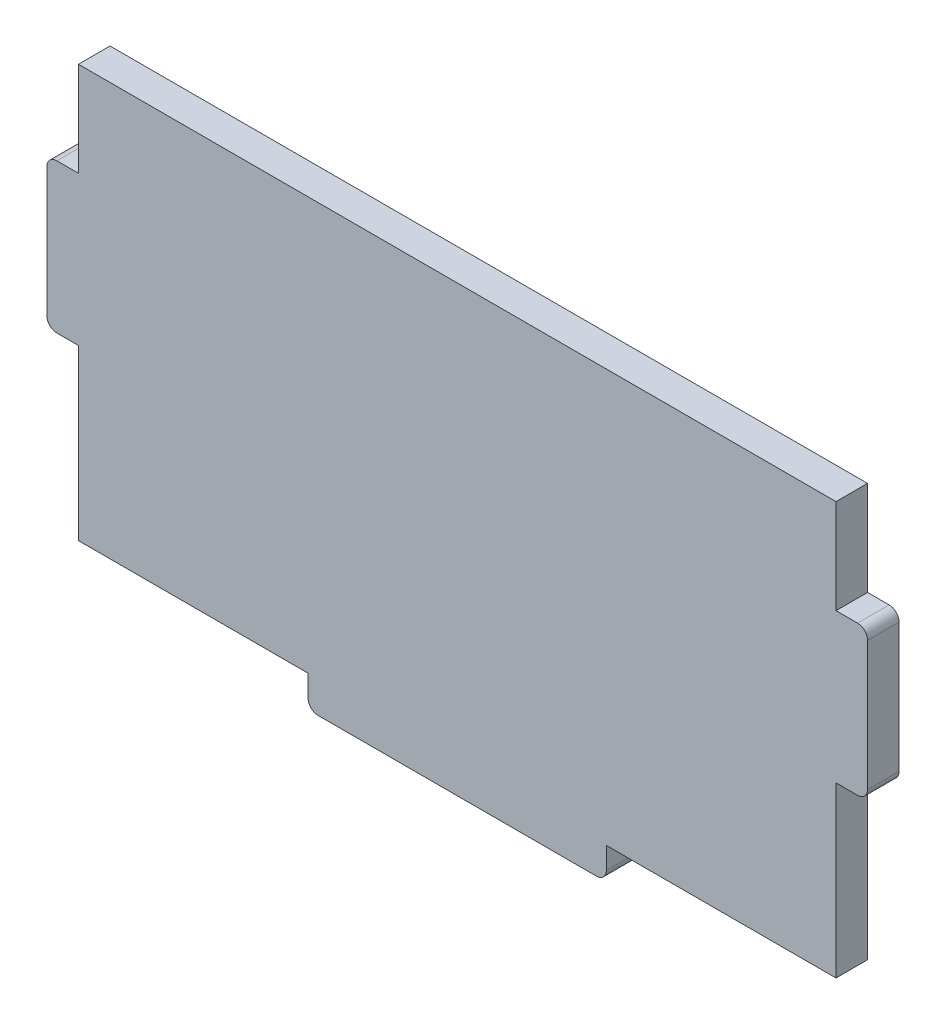
ISO-10303-21;
HEADER;
FILE_DESCRIPTION(('STEP AP214'),'2;1');
FILE_NAME('part.step','',(''),(''),'','','');
FILE_SCHEMA(('AUTOMOTIVE_DESIGN { 1 0 10303 214 1 1 1 1 }'));
ENDSEC;
DATA;
#1=APPLICATION_CONTEXT('core data for automotive mechanical design processes');
#2=APPLICATION_PROTOCOL_DEFINITION('international standard','automotive_design',2000,#1);
#3=PRODUCT_CONTEXT('',#1,'mechanical');
#4=PRODUCT('Part','Part','',(#3));
#5=PRODUCT_RELATED_PRODUCT_CATEGORY('part','',(#4));
#6=PRODUCT_DEFINITION_FORMATION('','',#4);
#7=PRODUCT_DEFINITION_CONTEXT('part definition',#1,'design');
#8=PRODUCT_DEFINITION('design','',#6,#7);
#9=PRODUCT_DEFINITION_SHAPE('','',#8);
#10=(LENGTH_UNIT() NAMED_UNIT(*) SI_UNIT(.MILLI.,.METRE.));
#11=(NAMED_UNIT(*) PLANE_ANGLE_UNIT() SI_UNIT($,.RADIAN.));
#12=(NAMED_UNIT(*) SI_UNIT($,.STERADIAN.) SOLID_ANGLE_UNIT());
#13=UNCERTAINTY_MEASURE_WITH_UNIT(LENGTH_MEASURE(1.E-05),#10,'distance_accuracy_value','');
#14=(GEOMETRIC_REPRESENTATION_CONTEXT(3) GLOBAL_UNCERTAINTY_ASSIGNED_CONTEXT((#13)) GLOBAL_UNIT_ASSIGNED_CONTEXT((#10,
#11,#12)) REPRESENTATION_CONTEXT('',''));
#15=CARTESIAN_POINT('',(0.,0.,0.));
#16=DIRECTION('',(0.,0.,1.));
#17=DIRECTION('',(1.,0.,0.));
#18=AXIS2_PLACEMENT_3D('',#15,#16,#17);
#19=CARTESIAN_POINT('',(-38.1,-20.75,3.175));
#20=DIRECTION('',(1.,0.,0.));
#21=DIRECTION('',(0.,1.,0.));
#22=AXIS2_PLACEMENT_3D('',#19,#20,#21);
#23=PLANE('',#22);
#24=DIRECTION('',(0.,0.,-1.));
#25=VECTOR('',#24,1.);
#26=CARTESIAN_POINT('',(-38.1,11.25,0.));
#27=LINE('',#26,#25);
#28=CARTESIAN_POINT('',(-38.1,11.25,3.175));
#29=VERTEX_POINT('',#28);
#30=CARTESIAN_POINT('',(-38.1,11.25,0.));
#31=VERTEX_POINT('',#30);
#32=EDGE_CURVE('E226',#29,#31,#27,.T.);
#33=ORIENTED_EDGE('',*,*,#32,.F.);
#34=DIRECTION('',(0.,-1.,0.));
#35=VECTOR('',#34,1.);
#36=CARTESIAN_POINT('',(-38.1,-20.75,3.175));
#37=LINE('',#36,#35);
#38=CARTESIAN_POINT('',(-38.1,20.75,3.175));
#39=VERTEX_POINT('',#38);
#40=EDGE_CURVE('E220',#39,#29,#37,.T.);
#41=ORIENTED_EDGE('',*,*,#40,.F.);
#42=DIRECTION('',(0.,0.,-1.));
#43=VECTOR('',#42,1.);
#44=CARTESIAN_POINT('',(-38.1,20.75,3.175));
#45=LINE('',#44,#43);
#46=CARTESIAN_POINT('',(-38.1,20.75,0.));
#47=VERTEX_POINT('',#46);
#48=EDGE_CURVE('E336',#39,#47,#45,.T.);
#49=ORIENTED_EDGE('',*,*,#48,.T.);
#50=DIRECTION('',(0.,-1.,0.));
#51=VECTOR('',#50,1.);
#52=CARTESIAN_POINT('',(-38.1,-20.75,0.));
#53=LINE('',#52,#51);
#54=EDGE_CURVE('E322',#47,#31,#53,.T.);
#55=ORIENTED_EDGE('',*,*,#54,.T.);
#56=EDGE_LOOP('',(#33,#41,#49,#55));
#57=FACE_BOUND('',#56,.T.);
#58=ADVANCED_FACE('F48',(#57),#23,.F.);
#59=DIRECTION('',(0.,0.,1.));
#60=VECTOR('',#59,1.);
#61=CARTESIAN_POINT('',(-38.1,-3.75000000000002,0.));
#62=LINE('',#61,#60);
#63=CARTESIAN_POINT('',(-38.1,-3.75000000000002,0.));
#64=VERTEX_POINT('',#63);
#65=CARTESIAN_POINT('',(-38.1,-3.75000000000002,3.175));
#66=VERTEX_POINT('',#65);
#67=EDGE_CURVE('E214',#64,#66,#62,.T.);
#68=ORIENTED_EDGE('',*,*,#67,.F.);
#69=CARTESIAN_POINT('',(-38.1,-20.75,0.));
#70=VERTEX_POINT('',#69);
#71=EDGE_CURVE('E321',#64,#70,#53,.T.);
#72=ORIENTED_EDGE('',*,*,#71,.T.);
#73=DIRECTION('',(0.,0.,-1.));
#74=VECTOR('',#73,1.);
#75=CARTESIAN_POINT('',(-38.1,-20.75,3.175));
#76=LINE('',#75,#74);
#77=CARTESIAN_POINT('',(-38.1,-20.75,3.175));
#78=VERTEX_POINT('',#77);
#79=EDGE_CURVE('E217',#78,#70,#76,.T.);
#80=ORIENTED_EDGE('',*,*,#79,.F.);
#81=EDGE_CURVE('E200',#66,#78,#37,.T.);
#82=ORIENTED_EDGE('',*,*,#81,.F.);
#83=EDGE_LOOP('',(#68,#72,#80,#82));
#84=FACE_BOUND('',#83,.T.);
#85=ADVANCED_FACE('F213',(#84),#23,.F.);
#86=CARTESIAN_POINT('',(-38.1,-20.75,3.175));
#87=DIRECTION('',(0.,1.,0.));
#88=DIRECTION('',(-1.,0.,0.));
#89=AXIS2_PLACEMENT_3D('',#86,#87,#88);
#90=PLANE('',#89);
#91=DIRECTION('',(0.,0.,-1.));
#92=VECTOR('',#91,1.);
#93=CARTESIAN_POINT('',(-15.,-20.75,3.175));
#94=LINE('',#93,#92);
#95=CARTESIAN_POINT('',(-15.,-20.75,3.175));
#96=VERTEX_POINT('',#95);
#97=CARTESIAN_POINT('',(-15.,-20.75,0.));
#98=VERTEX_POINT('',#97);
#99=EDGE_CURVE('E243',#96,#98,#94,.T.);
#100=ORIENTED_EDGE('',*,*,#99,.F.);
#101=DIRECTION('',(1.,0.,0.));
#102=VECTOR('',#101,1.);
#103=CARTESIAN_POINT('',(-38.1,-20.75,3.175));
#104=LINE('',#103,#102);
#105=EDGE_CURVE('E310',#78,#96,#104,.T.);
#106=ORIENTED_EDGE('',*,*,#105,.F.);
#107=ORIENTED_EDGE('',*,*,#79,.T.);
#108=DIRECTION('',(1.,0.,0.));
#109=VECTOR('',#108,1.);
#110=CARTESIAN_POINT('',(-38.1,-20.75,0.));
#111=LINE('',#110,#109);
#112=EDGE_CURVE('E327',#70,#98,#111,.T.);
#113=ORIENTED_EDGE('',*,*,#112,.T.);
#114=EDGE_LOOP('',(#100,#106,#107,#113));
#115=FACE_BOUND('',#114,.T.);
#116=ADVANCED_FACE('F494',(#115),#90,.F.);
#117=DIRECTION('',(0.,0.,1.));
#118=VECTOR('',#117,1.);
#119=CARTESIAN_POINT('',(15.,-20.75,3.175));
#120=LINE('',#119,#118);
#121=CARTESIAN_POINT('',(15.,-20.75,0.));
#122=VERTEX_POINT('',#121);
#123=CARTESIAN_POINT('',(15.,-20.75,3.175));
#124=VERTEX_POINT('',#123);
#125=EDGE_CURVE('E249',#122,#124,#120,.T.);
#126=ORIENTED_EDGE('',*,*,#125,.F.);
#127=CARTESIAN_POINT('',(38.1,-20.75,0.));
#128=VERTEX_POINT('',#127);
#129=EDGE_CURVE('E326',#122,#128,#111,.T.);
#130=ORIENTED_EDGE('',*,*,#129,.T.);
#131=DIRECTION('',(0.,0.,-1.));
#132=VECTOR('',#131,1.);
#133=CARTESIAN_POINT('',(38.1,-20.75,3.175));
#134=LINE('',#133,#132);
#135=CARTESIAN_POINT('',(38.1,-20.75,3.175));
#136=VERTEX_POINT('',#135);
#137=EDGE_CURVE('E313',#136,#128,#134,.T.);
#138=ORIENTED_EDGE('',*,*,#137,.F.);
#139=EDGE_CURVE('E309',#124,#136,#104,.T.);
#140=ORIENTED_EDGE('',*,*,#139,.F.);
#141=EDGE_LOOP('',(#126,#130,#138,#140));
#142=FACE_BOUND('',#141,.T.);
#143=ADVANCED_FACE('F441',(#142),#90,.F.);
#144=CARTESIAN_POINT('',(38.1,-20.75,3.175));
#145=DIRECTION('',(-1.,0.,0.));
#146=DIRECTION('',(0.,-1.,0.));
#147=AXIS2_PLACEMENT_3D('',#144,#145,#146);
#148=PLANE('',#147);
#149=DIRECTION('',(0.,0.,1.));
#150=VECTOR('',#149,1.);
#151=CARTESIAN_POINT('',(38.1,11.25,3.175));
#152=LINE('',#151,#150);
#153=CARTESIAN_POINT('',(38.1,11.25,0.));
#154=VERTEX_POINT('',#153);
#155=CARTESIAN_POINT('',(38.1,11.25,3.175));
#156=VERTEX_POINT('',#155);
#157=EDGE_CURVE('E277',#154,#156,#152,.T.);
#158=ORIENTED_EDGE('',*,*,#157,.F.);
#159=DIRECTION('',(0.,1.,0.));
#160=VECTOR('',#159,1.);
#161=CARTESIAN_POINT('',(38.1,-20.75,0.));
#162=LINE('',#161,#160);
#163=CARTESIAN_POINT('',(38.1,20.75,0.));
#164=VERTEX_POINT('',#163);
#165=EDGE_CURVE('E299',#154,#164,#162,.T.);
#166=ORIENTED_EDGE('',*,*,#165,.T.);
#167=DIRECTION('',(0.,0.,-1.));
#168=VECTOR('',#167,1.);
#169=CARTESIAN_POINT('',(38.1,20.75,3.175));
#170=LINE('',#169,#168);
#171=CARTESIAN_POINT('',(38.1,20.75,3.175));
#172=VERTEX_POINT('',#171);
#173=EDGE_CURVE('E340',#172,#164,#170,.T.);
#174=ORIENTED_EDGE('',*,*,#173,.F.);
#175=DIRECTION('',(0.,1.,0.));
#176=VECTOR('',#175,1.);
#177=CARTESIAN_POINT('',(38.1,-20.75,3.175));
#178=LINE('',#177,#176);
#179=EDGE_CURVE('E304',#156,#172,#178,.T.);
#180=ORIENTED_EDGE('',*,*,#179,.F.);
#181=EDGE_LOOP('',(#158,#166,#174,#180));
#182=FACE_BOUND('',#181,.T.);
#183=ADVANCED_FACE('F468',(#182),#148,.F.);
#184=DIRECTION('',(0.,0.,-1.));
#185=VECTOR('',#184,1.);
#186=CARTESIAN_POINT('',(38.1,-3.74999999999999,3.175));
#187=LINE('',#186,#185);
#188=CARTESIAN_POINT('',(38.1,-3.74999999999999,3.175));
#189=VERTEX_POINT('',#188);
#190=CARTESIAN_POINT('',(38.1,-3.74999999999999,0.));
#191=VERTEX_POINT('',#190);
#192=EDGE_CURVE('E271',#189,#191,#187,.T.);
#193=ORIENTED_EDGE('',*,*,#192,.F.);
#194=EDGE_CURVE('E300',#136,#189,#178,.T.);
#195=ORIENTED_EDGE('',*,*,#194,.F.);
#196=ORIENTED_EDGE('',*,*,#137,.T.);
#197=EDGE_CURVE('E314',#128,#191,#162,.T.);
#198=ORIENTED_EDGE('',*,*,#197,.T.);
#199=EDGE_LOOP('',(#193,#195,#196,#198));
#200=FACE_BOUND('',#199,.T.);
#201=ADVANCED_FACE('F446',(#200),#148,.F.);
#202=CARTESIAN_POINT('',(-38.1,20.75,3.175));
#203=DIRECTION('',(0.,-1.,0.));
#204=DIRECTION('',(1.,0.,0.));
#205=AXIS2_PLACEMENT_3D('',#202,#203,#204);
#206=PLANE('',#205);
#207=DIRECTION('',(-1.,0.,0.));
#208=VECTOR('',#207,1.);
#209=CARTESIAN_POINT('',(-38.1,20.75,0.));
#210=LINE('',#209,#208);
#211=EDGE_CURVE('E318',#164,#47,#210,.T.);
#212=ORIENTED_EDGE('',*,*,#211,.T.);
#213=ORIENTED_EDGE('',*,*,#48,.F.);
#214=DIRECTION('',(-1.,0.,0.));
#215=VECTOR('',#214,1.);
#216=CARTESIAN_POINT('',(-38.1,20.75,3.175));
#217=LINE('',#216,#215);
#218=EDGE_CURVE('E221',#172,#39,#217,.T.);
#219=ORIENTED_EDGE('',*,*,#218,.F.);
#220=ORIENTED_EDGE('',*,*,#173,.T.);
#221=EDGE_LOOP('',(#212,#213,#219,#220));
#222=FACE_BOUND('',#221,.T.);
#223=ADVANCED_FACE('F475',(#222),#206,.F.);
#224=CARTESIAN_POINT('',(0.,0.,3.175));
#225=DIRECTION('',(0.,0.,-1.));
#226=DIRECTION('',(-1.,0.,0.));
#227=AXIS2_PLACEMENT_3D('',#224,#225,#226);
#228=PLANE('',#227);
#229=DIRECTION('',(0.,-1.,0.));
#230=VECTOR('',#229,1.);
#231=CARTESIAN_POINT('',(41.275,11.25,3.175));
#232=LINE('',#231,#230);
#233=CARTESIAN_POINT('',(41.275,10.25,3.175));
#234=VERTEX_POINT('',#233);
#235=CARTESIAN_POINT('',(41.275,-2.74999999999999,3.175));
#236=VERTEX_POINT('',#235);
#237=EDGE_CURVE('E272',#234,#236,#232,.T.);
#238=ORIENTED_EDGE('',*,*,#237,.F.);
#239=CARTESIAN_POINT('',(40.275,10.25,3.175));
#240=DIRECTION('',(0.,0.,-1.));
#241=DIRECTION('',(-1.,0.,0.));
#242=AXIS2_PLACEMENT_3D('',#239,#240,#241);
#243=CIRCLE('',#242,1.);
#244=CARTESIAN_POINT('',(40.275,11.25,3.175));
#245=VERTEX_POINT('',#244);
#246=EDGE_CURVE('E366',#234,#245,#243,.F.);
#247=ORIENTED_EDGE('',*,*,#246,.T.);
#248=DIRECTION('',(-1.,0.,0.));
#249=VECTOR('',#248,1.);
#250=CARTESIAN_POINT('',(41.275,11.25,3.175));
#251=LINE('',#250,#249);
#252=EDGE_CURVE('E281',#245,#156,#251,.T.);
#253=ORIENTED_EDGE('',*,*,#252,.T.);
#254=ORIENTED_EDGE('',*,*,#179,.T.);
#255=ORIENTED_EDGE('',*,*,#218,.T.);
#256=ORIENTED_EDGE('',*,*,#40,.T.);
#257=DIRECTION('',(1.,0.,0.));
#258=VECTOR('',#257,1.);
#259=CARTESIAN_POINT('',(-41.275,11.25,3.175));
#260=LINE('',#259,#258);
#261=CARTESIAN_POINT('',(-40.275,11.25,3.175));
#262=VERTEX_POINT('',#261);
#263=EDGE_CURVE('E209',#262,#29,#260,.T.);
#264=ORIENTED_EDGE('',*,*,#263,.F.);
#265=CARTESIAN_POINT('',(-40.275,10.25,3.175));
#266=DIRECTION('',(0.,0.,-1.));
#267=DIRECTION('',(-1.,0.,0.));
#268=AXIS2_PLACEMENT_3D('',#265,#266,#267);
#269=CIRCLE('',#268,1.);
#270=CARTESIAN_POINT('',(-41.275,10.25,3.175));
#271=VERTEX_POINT('',#270);
#272=EDGE_CURVE('E352',#262,#271,#269,.F.);
#273=ORIENTED_EDGE('',*,*,#272,.T.);
#274=DIRECTION('',(0.,1.,0.));
#275=VECTOR('',#274,1.);
#276=CARTESIAN_POINT('',(-41.275,11.25,3.175));
#277=LINE('',#276,#275);
#278=CARTESIAN_POINT('',(-41.275,-2.75000000000002,3.175));
#279=VERTEX_POINT('',#278);
#280=EDGE_CURVE('E233',#279,#271,#277,.T.);
#281=ORIENTED_EDGE('',*,*,#280,.F.);
#282=CARTESIAN_POINT('',(-40.275,-2.75000000000002,3.175));
#283=DIRECTION('',(0.,0.,-1.));
#284=DIRECTION('',(-1.,0.,0.));
#285=AXIS2_PLACEMENT_3D('',#282,#283,#284);
#286=CIRCLE('',#285,1.);
#287=CARTESIAN_POINT('',(-40.275,-3.75000000000002,3.175));
#288=VERTEX_POINT('',#287);
#289=EDGE_CURVE('E203',#279,#288,#286,.F.);
#290=ORIENTED_EDGE('',*,*,#289,.T.);
#291=DIRECTION('',(1.,0.,0.));
#292=VECTOR('',#291,1.);
#293=CARTESIAN_POINT('',(-41.275,-3.75000000000002,3.175));
#294=LINE('',#293,#292);
#295=EDGE_CURVE('E195',#288,#66,#294,.T.);
#296=ORIENTED_EDGE('',*,*,#295,.T.);
#297=ORIENTED_EDGE('',*,*,#81,.T.);
#298=ORIENTED_EDGE('',*,*,#105,.T.);
#299=DIRECTION('',(0.,1.,0.));
#300=VECTOR('',#299,1.);
#301=CARTESIAN_POINT('',(-15.,-23.925,3.175));
#302=LINE('',#301,#300);
#303=CARTESIAN_POINT('',(-15.,-22.925,3.175));
#304=VERTEX_POINT('',#303);
#305=EDGE_CURVE('E253',#304,#96,#302,.T.);
#306=ORIENTED_EDGE('',*,*,#305,.F.);
#307=CARTESIAN_POINT('',(-14.,-22.925,3.175));
#308=DIRECTION('',(0.,0.,-1.));
#309=DIRECTION('',(-1.,0.,0.));
#310=AXIS2_PLACEMENT_3D('',#307,#308,#309);
#311=CIRCLE('',#310,1.);
#312=CARTESIAN_POINT('',(-14.,-23.925,3.175));
#313=VERTEX_POINT('',#312);
#314=EDGE_CURVE('E357',#304,#313,#311,.F.);
#315=ORIENTED_EDGE('',*,*,#314,.T.);
#316=DIRECTION('',(-1.,0.,0.));
#317=VECTOR('',#316,1.);
#318=CARTESIAN_POINT('',(-15.,-23.925,3.175));
#319=LINE('',#318,#317);
#320=CARTESIAN_POINT('',(14.,-23.925,3.175));
#321=VERTEX_POINT('',#320);
#322=EDGE_CURVE('E248',#321,#313,#319,.T.);
#323=ORIENTED_EDGE('',*,*,#322,.F.);
#324=CARTESIAN_POINT('',(14.,-22.925,3.175));
#325=DIRECTION('',(0.,0.,-1.));
#326=DIRECTION('',(-1.,0.,0.));
#327=AXIS2_PLACEMENT_3D('',#324,#325,#326);
#328=CIRCLE('',#327,1.);
#329=CARTESIAN_POINT('',(15.,-22.925,3.175));
#330=VERTEX_POINT('',#329);
#331=EDGE_CURVE('E360',#321,#330,#328,.F.);
#332=ORIENTED_EDGE('',*,*,#331,.T.);
#333=DIRECTION('',(0.,1.,0.));
#334=VECTOR('',#333,1.);
#335=CARTESIAN_POINT('',(15.,-23.925,3.175));
#336=LINE('',#335,#334);
#337=EDGE_CURVE('E262',#330,#124,#336,.T.);
#338=ORIENTED_EDGE('',*,*,#337,.T.);
#339=ORIENTED_EDGE('',*,*,#139,.T.);
#340=ORIENTED_EDGE('',*,*,#194,.T.);
#341=DIRECTION('',(-1.,0.,0.));
#342=VECTOR('',#341,1.);
#343=CARTESIAN_POINT('',(41.275,-3.74999999999999,3.175));
#344=LINE('',#343,#342);
#345=CARTESIAN_POINT('',(40.275,-3.74999999999999,3.175));
#346=VERTEX_POINT('',#345);
#347=EDGE_CURVE('E296',#346,#189,#344,.T.);
#348=ORIENTED_EDGE('',*,*,#347,.F.);
#349=CARTESIAN_POINT('',(40.275,-2.74999999999999,3.175));
#350=DIRECTION('',(0.,0.,-1.));
#351=DIRECTION('',(-1.,0.,0.));
#352=AXIS2_PLACEMENT_3D('',#349,#350,#351);
#353=CIRCLE('',#352,1.);
#354=EDGE_CURVE('E363',#346,#236,#353,.F.);
#355=ORIENTED_EDGE('',*,*,#354,.T.);
#356=EDGE_LOOP('',(#238,#247,#253,#254,#255,#256,#264,#273,#281,#290,#296,#297,#298,#306,#315,
#323,#332,#338,#339,#340,#348,#355));
#357=FACE_BOUND('',#356,.T.);
#358=ADVANCED_FACE('F198',(#357),#228,.F.);
#359=CARTESIAN_POINT('',(0.,0.,0.));
#360=DIRECTION('',(0.,0.,-1.));
#361=DIRECTION('',(-1.,0.,0.));
#362=AXIS2_PLACEMENT_3D('',#359,#360,#361);
#363=PLANE('',#362);
#364=DIRECTION('',(-1.,0.,0.));
#365=VECTOR('',#364,1.);
#366=CARTESIAN_POINT('',(41.275,11.25,0.));
#367=LINE('',#366,#365);
#368=CARTESIAN_POINT('',(40.275,11.25,0.));
#369=VERTEX_POINT('',#368);
#370=EDGE_CURVE('E290',#369,#154,#367,.T.);
#371=ORIENTED_EDGE('',*,*,#370,.F.);
#372=CARTESIAN_POINT('',(40.275,10.25,0.));
#373=DIRECTION('',(0.,0.,-1.));
#374=DIRECTION('',(-1.,0.,0.));
#375=AXIS2_PLACEMENT_3D('',#372,#373,#374);
#376=CIRCLE('',#375,1.);
#377=CARTESIAN_POINT('',(41.275,10.25,0.));
#378=VERTEX_POINT('',#377);
#379=EDGE_CURVE('E385',#369,#378,#376,.T.);
#380=ORIENTED_EDGE('',*,*,#379,.T.);
#381=DIRECTION('',(0.,1.,0.));
#382=VECTOR('',#381,1.);
#383=CARTESIAN_POINT('',(41.275,11.25,0.));
#384=LINE('',#383,#382);
#385=CARTESIAN_POINT('',(41.275,-2.74999999999999,0.));
#386=VERTEX_POINT('',#385);
#387=EDGE_CURVE('E276',#386,#378,#384,.T.);
#388=ORIENTED_EDGE('',*,*,#387,.F.);
#389=CARTESIAN_POINT('',(40.275,-2.74999999999999,0.));
#390=DIRECTION('',(0.,0.,-1.));
#391=DIRECTION('',(-1.,0.,0.));
#392=AXIS2_PLACEMENT_3D('',#389,#390,#391);
#393=CIRCLE('',#392,1.);
#394=CARTESIAN_POINT('',(40.275,-3.74999999999999,0.));
#395=VERTEX_POINT('',#394);
#396=EDGE_CURVE('E64',#386,#395,#393,.T.);
#397=ORIENTED_EDGE('',*,*,#396,.T.);
#398=DIRECTION('',(-1.,0.,0.));
#399=VECTOR('',#398,1.);
#400=CARTESIAN_POINT('',(41.275,-3.74999999999999,0.));
#401=LINE('',#400,#399);
#402=EDGE_CURVE('E293',#395,#191,#401,.T.);
#403=ORIENTED_EDGE('',*,*,#402,.T.);
#404=ORIENTED_EDGE('',*,*,#197,.F.);
#405=ORIENTED_EDGE('',*,*,#129,.F.);
#406=DIRECTION('',(0.,1.,0.));
#407=VECTOR('',#406,1.);
#408=CARTESIAN_POINT('',(15.,-23.925,0.));
#409=LINE('',#408,#407);
#410=CARTESIAN_POINT('',(15.,-22.925,0.));
#411=VERTEX_POINT('',#410);
#412=EDGE_CURVE('E265',#411,#122,#409,.T.);
#413=ORIENTED_EDGE('',*,*,#412,.F.);
#414=CARTESIAN_POINT('',(14.,-22.925,0.));
#415=DIRECTION('',(0.,0.,-1.));
#416=DIRECTION('',(-1.,0.,0.));
#417=AXIS2_PLACEMENT_3D('',#414,#415,#416);
#418=CIRCLE('',#417,1.);
#419=CARTESIAN_POINT('',(14.,-23.925,0.));
#420=VERTEX_POINT('',#419);
#421=EDGE_CURVE('E380',#411,#420,#418,.T.);
#422=ORIENTED_EDGE('',*,*,#421,.T.);
#423=DIRECTION('',(1.,0.,0.));
#424=VECTOR('',#423,1.);
#425=CARTESIAN_POINT('',(-15.,-23.925,0.));
#426=LINE('',#425,#424);
#427=CARTESIAN_POINT('',(-14.,-23.925,0.));
#428=VERTEX_POINT('',#427);
#429=EDGE_CURVE('E244',#428,#420,#426,.T.);
#430=ORIENTED_EDGE('',*,*,#429,.F.);
#431=CARTESIAN_POINT('',(-14.,-22.925,0.));
#432=DIRECTION('',(0.,0.,-1.));
#433=DIRECTION('',(-1.,0.,0.));
#434=AXIS2_PLACEMENT_3D('',#431,#432,#433);
#435=CIRCLE('',#434,1.);
#436=CARTESIAN_POINT('',(-15.,-22.925,0.));
#437=VERTEX_POINT('',#436);
#438=EDGE_CURVE('E377',#428,#437,#435,.T.);
#439=ORIENTED_EDGE('',*,*,#438,.T.);
#440=DIRECTION('',(0.,1.,0.));
#441=VECTOR('',#440,1.);
#442=CARTESIAN_POINT('',(-15.,-23.925,0.));
#443=LINE('',#442,#441);
#444=EDGE_CURVE('E268',#437,#98,#443,.T.);
#445=ORIENTED_EDGE('',*,*,#444,.T.);
#446=ORIENTED_EDGE('',*,*,#112,.F.);
#447=ORIENTED_EDGE('',*,*,#71,.F.);
#448=DIRECTION('',(1.,0.,0.));
#449=VECTOR('',#448,1.);
#450=CARTESIAN_POINT('',(-41.275,-3.75000000000002,0.));
#451=LINE('',#450,#449);
#452=CARTESIAN_POINT('',(-40.275,-3.75000000000002,0.));
#453=VERTEX_POINT('',#452);
#454=EDGE_CURVE('E208',#453,#64,#451,.T.);
#455=ORIENTED_EDGE('',*,*,#454,.F.);
#456=CARTESIAN_POINT('',(-40.275,-2.75000000000002,0.));
#457=DIRECTION('',(0.,0.,-1.));
#458=DIRECTION('',(-1.,0.,0.));
#459=AXIS2_PLACEMENT_3D('',#456,#457,#458);
#460=CIRCLE('',#459,1.);
#461=CARTESIAN_POINT('',(-41.275,-2.75000000000002,0.));
#462=VERTEX_POINT('',#461);
#463=EDGE_CURVE('E374',#453,#462,#460,.T.);
#464=ORIENTED_EDGE('',*,*,#463,.T.);
#465=DIRECTION('',(0.,-1.,0.));
#466=VECTOR('',#465,1.);
#467=CARTESIAN_POINT('',(-41.275,11.25,0.));
#468=LINE('',#467,#466);
#469=CARTESIAN_POINT('',(-41.275,10.25,0.));
#470=VERTEX_POINT('',#469);
#471=EDGE_CURVE('E230',#470,#462,#468,.T.);
#472=ORIENTED_EDGE('',*,*,#471,.F.);
#473=CARTESIAN_POINT('',(-40.275,10.25,0.));
#474=DIRECTION('',(0.,0.,-1.));
#475=DIRECTION('',(-1.,0.,0.));
#476=AXIS2_PLACEMENT_3D('',#473,#474,#475);
#477=CIRCLE('',#476,1.);
#478=CARTESIAN_POINT('',(-40.275,11.25,0.));
#479=VERTEX_POINT('',#478);
#480=EDGE_CURVE('E71',#470,#479,#477,.T.);
#481=ORIENTED_EDGE('',*,*,#480,.T.);
#482=DIRECTION('',(1.,0.,0.));
#483=VECTOR('',#482,1.);
#484=CARTESIAN_POINT('',(-41.275,11.25,0.));
#485=LINE('',#484,#483);
#486=EDGE_CURVE('E236',#479,#31,#485,.T.);
#487=ORIENTED_EDGE('',*,*,#486,.T.);
#488=ORIENTED_EDGE('',*,*,#54,.F.);
#489=ORIENTED_EDGE('',*,*,#211,.F.);
#490=ORIENTED_EDGE('',*,*,#165,.F.);
#491=EDGE_LOOP('',(#371,#380,#388,#397,#403,#404,#405,#413,#422,#430,#439,#445,#446,#447,#455,
#464,#472,#481,#487,#488,#489,#490));
#492=FACE_BOUND('',#491,.T.);
#493=ADVANCED_FACE('F416',(#492),#363,.T.);
#494=CARTESIAN_POINT('',(41.275,-3.74999999999999,3.175));
#495=DIRECTION('',(0.,1.,0.));
#496=DIRECTION('',(-1.,0.,0.));
#497=AXIS2_PLACEMENT_3D('',#494,#495,#496);
#498=PLANE('',#497);
#499=ORIENTED_EDGE('',*,*,#402,.F.);
#500=DIRECTION('',(0.,0.,-1.));
#501=VECTOR('',#500,1.);
#502=CARTESIAN_POINT('',(40.275,-3.74999999999999,3.175));
#503=LINE('',#502,#501);
#504=EDGE_CURVE('E388',#395,#346,#503,.F.);
#505=ORIENTED_EDGE('',*,*,#504,.T.);
#506=ORIENTED_EDGE('',*,*,#347,.T.);
#507=ORIENTED_EDGE('',*,*,#192,.T.);
#508=EDGE_LOOP('',(#499,#505,#506,#507));
#509=FACE_BOUND('',#508,.T.);
#510=ADVANCED_FACE('F448',(#509),#498,.F.);
#511=CARTESIAN_POINT('',(41.275,11.25,3.175));
#512=DIRECTION('',(0.,-1.,0.));
#513=DIRECTION('',(1.,0.,0.));
#514=AXIS2_PLACEMENT_3D('',#511,#512,#513);
#515=PLANE('',#514);
#516=ORIENTED_EDGE('',*,*,#252,.F.);
#517=DIRECTION('',(0.,0.,1.));
#518=VECTOR('',#517,1.);
#519=CARTESIAN_POINT('',(40.275,11.25,0.));
#520=LINE('',#519,#518);
#521=EDGE_CURVE('E369',#245,#369,#520,.F.);
#522=ORIENTED_EDGE('',*,*,#521,.T.);
#523=ORIENTED_EDGE('',*,*,#370,.T.);
#524=ORIENTED_EDGE('',*,*,#157,.T.);
#525=EDGE_LOOP('',(#516,#522,#523,#524));
#526=FACE_BOUND('',#525,.T.);
#527=ADVANCED_FACE('F465',(#526),#515,.F.);
#528=CARTESIAN_POINT('',(41.275,0.,0.));
#529=DIRECTION('',(1.,0.,0.));
#530=DIRECTION('',(0.,0.,-1.));
#531=AXIS2_PLACEMENT_3D('',#528,#529,#530);
#532=PLANE('',#531);
#533=ORIENTED_EDGE('',*,*,#387,.T.);
#534=DIRECTION('',(0.,0.,1.));
#535=VECTOR('',#534,1.);
#536=CARTESIAN_POINT('',(41.275,10.25,3.175));
#537=LINE('',#536,#535);
#538=EDGE_CURVE('E348',#378,#234,#537,.T.);
#539=ORIENTED_EDGE('',*,*,#538,.T.);
#540=ORIENTED_EDGE('',*,*,#237,.T.);
#541=DIRECTION('',(0.,0.,-1.));
#542=VECTOR('',#541,1.);
#543=CARTESIAN_POINT('',(41.275,-2.74999999999999,0.));
#544=LINE('',#543,#542);
#545=EDGE_CURVE('E344',#236,#386,#544,.T.);
#546=ORIENTED_EDGE('',*,*,#545,.T.);
#547=EDGE_LOOP('',(#533,#539,#540,#546));
#548=FACE_BOUND('',#547,.T.);
#549=ADVANCED_FACE('F455',(#548),#532,.T.);
#550=CARTESIAN_POINT('',(-15.,-23.925,3.175));
#551=DIRECTION('',(1.,0.,0.));
#552=DIRECTION('',(0.,1.,0.));
#553=AXIS2_PLACEMENT_3D('',#550,#551,#552);
#554=PLANE('',#553);
#555=ORIENTED_EDGE('',*,*,#444,.F.);
#556=DIRECTION('',(0.,0.,-1.));
#557=VECTOR('',#556,1.);
#558=CARTESIAN_POINT('',(-15.,-22.925,3.175));
#559=LINE('',#558,#557);
#560=EDGE_CURVE('E402',#437,#304,#559,.F.);
#561=ORIENTED_EDGE('',*,*,#560,.T.);
#562=ORIENTED_EDGE('',*,*,#305,.T.);
#563=ORIENTED_EDGE('',*,*,#99,.T.);
#564=EDGE_LOOP('',(#555,#561,#562,#563));
#565=FACE_BOUND('',#564,.T.);
#566=ADVANCED_FACE('F530',(#565),#554,.F.);
#567=CARTESIAN_POINT('',(15.,-23.925,3.175));
#568=DIRECTION('',(-1.,0.,0.));
#569=DIRECTION('',(0.,-1.,0.));
#570=AXIS2_PLACEMENT_3D('',#567,#568,#569);
#571=PLANE('',#570);
#572=ORIENTED_EDGE('',*,*,#337,.F.);
#573=DIRECTION('',(0.,0.,1.));
#574=VECTOR('',#573,1.);
#575=CARTESIAN_POINT('',(15.,-22.925,0.));
#576=LINE('',#575,#574);
#577=EDGE_CURVE('E399',#330,#411,#576,.F.);
#578=ORIENTED_EDGE('',*,*,#577,.T.);
#579=ORIENTED_EDGE('',*,*,#412,.T.);
#580=ORIENTED_EDGE('',*,*,#125,.T.);
#581=EDGE_LOOP('',(#572,#578,#579,#580));
#582=FACE_BOUND('',#581,.T.);
#583=ADVANCED_FACE('F526',(#582),#571,.F.);
#584=CARTESIAN_POINT('',(0.,-23.925,0.));
#585=DIRECTION('',(0.,-1.,0.));
#586=DIRECTION('',(1.,0.,0.));
#587=AXIS2_PLACEMENT_3D('',#584,#585,#586);
#588=PLANE('',#587);
#589=ORIENTED_EDGE('',*,*,#429,.T.);
#590=DIRECTION('',(0.,0.,1.));
#591=VECTOR('',#590,1.);
#592=CARTESIAN_POINT('',(14.,-23.925,3.175));
#593=LINE('',#592,#591);
#594=EDGE_CURVE('E395',#420,#321,#593,.T.);
#595=ORIENTED_EDGE('',*,*,#594,.T.);
#596=ORIENTED_EDGE('',*,*,#322,.T.);
#597=DIRECTION('',(0.,0.,-1.));
#598=VECTOR('',#597,1.);
#599=CARTESIAN_POINT('',(-14.,-23.925,0.));
#600=LINE('',#599,#598);
#601=EDGE_CURVE('E391',#313,#428,#600,.T.);
#602=ORIENTED_EDGE('',*,*,#601,.T.);
#603=EDGE_LOOP('',(#589,#595,#596,#602));
#604=FACE_BOUND('',#603,.T.);
#605=ADVANCED_FACE('F520',(#604),#588,.T.);
#606=CARTESIAN_POINT('',(-41.275,-3.75000000000002,0.));
#607=DIRECTION('',(0.,1.,0.));
#608=DIRECTION('',(-1.,0.,0.));
#609=AXIS2_PLACEMENT_3D('',#606,#607,#608);
#610=PLANE('',#609);
#611=ORIENTED_EDGE('',*,*,#295,.F.);
#612=DIRECTION('',(0.,0.,1.));
#613=VECTOR('',#612,1.);
#614=CARTESIAN_POINT('',(-40.275,-3.75000000000002,0.));
#615=LINE('',#614,#613);
#616=EDGE_CURVE('E57',#288,#453,#615,.F.);
#617=ORIENTED_EDGE('',*,*,#616,.T.);
#618=ORIENTED_EDGE('',*,*,#454,.T.);
#619=ORIENTED_EDGE('',*,*,#67,.T.);
#620=EDGE_LOOP('',(#611,#617,#618,#619));
#621=FACE_BOUND('',#620,.T.);
#622=ADVANCED_FACE('F223',(#621),#610,.F.);
#623=CARTESIAN_POINT('',(-41.275,11.25,0.));
#624=DIRECTION('',(0.,-1.,0.));
#625=DIRECTION('',(1.,0.,0.));
#626=AXIS2_PLACEMENT_3D('',#623,#624,#625);
#627=PLANE('',#626);
#628=ORIENTED_EDGE('',*,*,#486,.F.);
#629=DIRECTION('',(0.,0.,-1.));
#630=VECTOR('',#629,1.);
#631=CARTESIAN_POINT('',(-40.275,11.25,3.175));
#632=LINE('',#631,#630);
#633=EDGE_CURVE('E11',#479,#262,#632,.F.);
#634=ORIENTED_EDGE('',*,*,#633,.T.);
#635=ORIENTED_EDGE('',*,*,#263,.T.);
#636=ORIENTED_EDGE('',*,*,#32,.T.);
#637=EDGE_LOOP('',(#628,#634,#635,#636));
#638=FACE_BOUND('',#637,.T.);
#639=ADVANCED_FACE('F480',(#638),#627,.F.);
#640=CARTESIAN_POINT('',(-41.275,0.,0.));
#641=DIRECTION('',(-1.,0.,0.));
#642=DIRECTION('',(0.,0.,1.));
#643=AXIS2_PLACEMENT_3D('',#640,#641,#642);
#644=PLANE('',#643);
#645=ORIENTED_EDGE('',*,*,#471,.T.);
#646=DIRECTION('',(0.,0.,1.));
#647=VECTOR('',#646,1.);
#648=CARTESIAN_POINT('',(-41.275,-2.75000000000002,3.175));
#649=LINE('',#648,#647);
#650=EDGE_CURVE('E409',#462,#279,#649,.T.);
#651=ORIENTED_EDGE('',*,*,#650,.T.);
#652=ORIENTED_EDGE('',*,*,#280,.T.);
#653=DIRECTION('',(0.,0.,-1.));
#654=VECTOR('',#653,1.);
#655=CARTESIAN_POINT('',(-41.275,10.25,0.));
#656=LINE('',#655,#654);
#657=EDGE_CURVE('E405',#271,#470,#656,.T.);
#658=ORIENTED_EDGE('',*,*,#657,.T.);
#659=EDGE_LOOP('',(#645,#651,#652,#658));
#660=FACE_BOUND('',#659,.T.);
#661=ADVANCED_FACE('F423',(#660),#644,.T.);
#662=CARTESIAN_POINT('',(40.275,10.25,0.));
#663=DIRECTION('',(0.,0.,-1.));
#664=DIRECTION('',(-1.,0.,0.));
#665=AXIS2_PLACEMENT_3D('',#662,#663,#664);
#666=CYLINDRICAL_SURFACE('',#665,1.);
#667=ORIENTED_EDGE('',*,*,#379,.F.);
#668=ORIENTED_EDGE('',*,*,#521,.F.);
#669=ORIENTED_EDGE('',*,*,#246,.F.);
#670=ORIENTED_EDGE('',*,*,#538,.F.);
#671=EDGE_LOOP('',(#667,#668,#669,#670));
#672=FACE_BOUND('',#671,.T.);
#673=ADVANCED_FACE('F461',(#672),#666,.T.);
#674=CARTESIAN_POINT('',(40.275,-2.74999999999999,0.));
#675=DIRECTION('',(0.,0.,1.));
#676=DIRECTION('',(1.,0.,0.));
#677=AXIS2_PLACEMENT_3D('',#674,#675,#676);
#678=CYLINDRICAL_SURFACE('',#677,1.);
#679=ORIENTED_EDGE('',*,*,#354,.F.);
#680=ORIENTED_EDGE('',*,*,#504,.F.);
#681=ORIENTED_EDGE('',*,*,#396,.F.);
#682=ORIENTED_EDGE('',*,*,#545,.F.);
#683=EDGE_LOOP('',(#679,#680,#681,#682));
#684=FACE_BOUND('',#683,.T.);
#685=ADVANCED_FACE('F453',(#684),#678,.T.);
#686=CARTESIAN_POINT('',(14.,-22.925,0.));
#687=DIRECTION('',(0.,0.,-1.));
#688=DIRECTION('',(-1.,0.,0.));
#689=AXIS2_PLACEMENT_3D('',#686,#687,#688);
#690=CYLINDRICAL_SURFACE('',#689,1.);
#691=ORIENTED_EDGE('',*,*,#421,.F.);
#692=ORIENTED_EDGE('',*,*,#577,.F.);
#693=ORIENTED_EDGE('',*,*,#331,.F.);
#694=ORIENTED_EDGE('',*,*,#594,.F.);
#695=EDGE_LOOP('',(#691,#692,#693,#694));
#696=FACE_BOUND('',#695,.T.);
#697=ADVANCED_FACE('F506',(#696),#690,.T.);
#698=CARTESIAN_POINT('',(-14.,-22.925,0.));
#699=DIRECTION('',(0.,0.,1.));
#700=DIRECTION('',(1.,0.,0.));
#701=AXIS2_PLACEMENT_3D('',#698,#699,#700);
#702=CYLINDRICAL_SURFACE('',#701,1.);
#703=ORIENTED_EDGE('',*,*,#314,.F.);
#704=ORIENTED_EDGE('',*,*,#560,.F.);
#705=ORIENTED_EDGE('',*,*,#438,.F.);
#706=ORIENTED_EDGE('',*,*,#601,.F.);
#707=EDGE_LOOP('',(#703,#704,#705,#706));
#708=FACE_BOUND('',#707,.T.);
#709=ADVANCED_FACE('F487',(#708),#702,.T.);
#710=CARTESIAN_POINT('',(-40.275,-2.75000000000002,0.));
#711=DIRECTION('',(0.,0.,-1.));
#712=DIRECTION('',(-1.,0.,0.));
#713=AXIS2_PLACEMENT_3D('',#710,#711,#712);
#714=CYLINDRICAL_SURFACE('',#713,1.);
#715=ORIENTED_EDGE('',*,*,#463,.F.);
#716=ORIENTED_EDGE('',*,*,#616,.F.);
#717=ORIENTED_EDGE('',*,*,#289,.F.);
#718=ORIENTED_EDGE('',*,*,#650,.F.);
#719=EDGE_LOOP('',(#715,#716,#717,#718));
#720=FACE_BOUND('',#719,.T.);
#721=ADVANCED_FACE('F420',(#720),#714,.T.);
#722=CARTESIAN_POINT('',(-40.275,10.25,0.));
#723=DIRECTION('',(0.,0.,1.));
#724=DIRECTION('',(1.,0.,0.));
#725=AXIS2_PLACEMENT_3D('',#722,#723,#724);
#726=CYLINDRICAL_SURFACE('',#725,1.);
#727=ORIENTED_EDGE('',*,*,#272,.F.);
#728=ORIENTED_EDGE('',*,*,#633,.F.);
#729=ORIENTED_EDGE('',*,*,#480,.F.);
#730=ORIENTED_EDGE('',*,*,#657,.F.);
#731=EDGE_LOOP('',(#727,#728,#729,#730));
#732=FACE_BOUND('',#731,.T.);
#733=ADVANCED_FACE('F50',(#732),#726,.T.);
#734=CLOSED_SHELL('',(#58,#85,#116,#143,#183,#201,#223,#358,#493,#510,#527,#549,#566,#583,#605,
#622,#639,#661,#673,#685,#697,#709,#721,#733));
#735=MANIFOLD_SOLID_BREP('B2',#734);
#736=ADVANCED_BREP_SHAPE_REPRESENTATION('',(#18,#735),#14);
#737=SHAPE_DEFINITION_REPRESENTATION(#9,#736);
ENDSEC;
END-ISO-10303-21;
